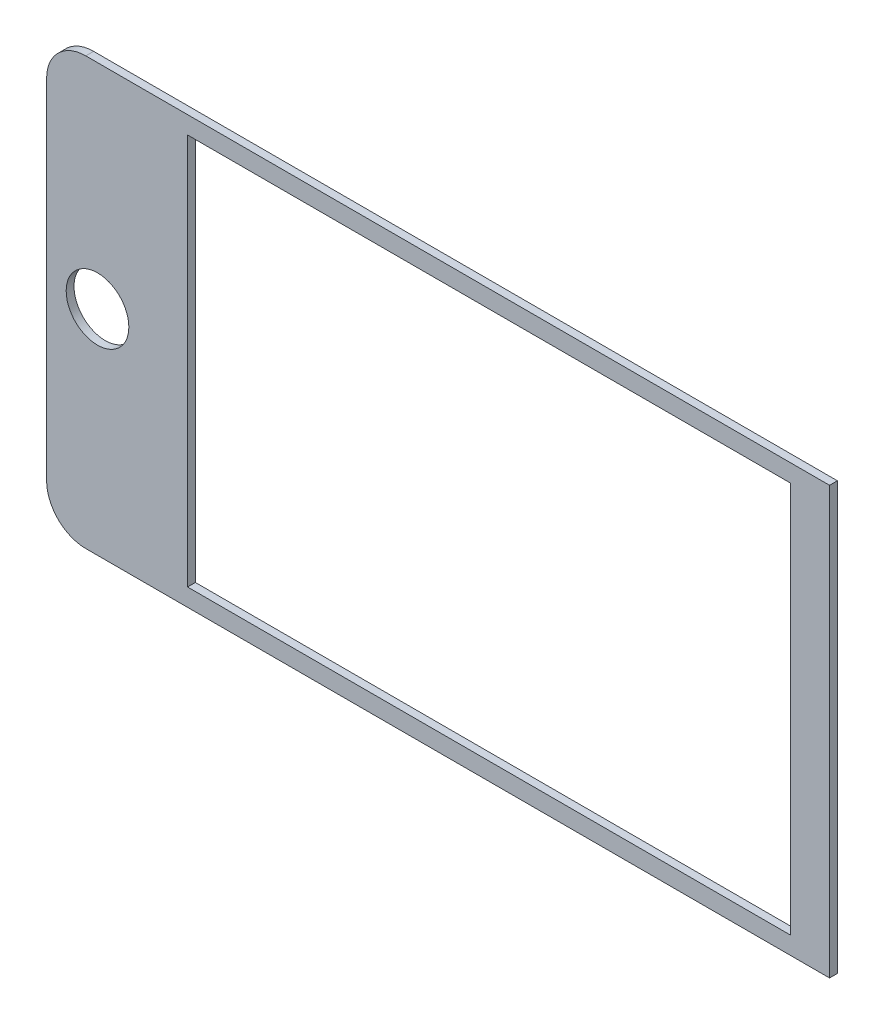
ISO-10303-21;
HEADER;
FILE_DESCRIPTION(('STEP AP214'),'2;1');
FILE_NAME('part.step','',(''),(''),'','','');
FILE_SCHEMA(('AUTOMOTIVE_DESIGN { 1 0 10303 214 1 1 1 1 }'));
ENDSEC;
DATA;
#1=APPLICATION_CONTEXT('core data for automotive mechanical design processes');
#2=APPLICATION_PROTOCOL_DEFINITION('international standard','automotive_design',2000,#1);
#3=PRODUCT_CONTEXT('',#1,'mechanical');
#4=PRODUCT('Part','Part','',(#3));
#5=PRODUCT_RELATED_PRODUCT_CATEGORY('part','',(#4));
#6=PRODUCT_DEFINITION_FORMATION('','',#4);
#7=PRODUCT_DEFINITION_CONTEXT('part definition',#1,'design');
#8=PRODUCT_DEFINITION('design','',#6,#7);
#9=PRODUCT_DEFINITION_SHAPE('','',#8);
#10=(LENGTH_UNIT() NAMED_UNIT(*) SI_UNIT(.MILLI.,.METRE.));
#11=(NAMED_UNIT(*) PLANE_ANGLE_UNIT() SI_UNIT($,.RADIAN.));
#12=(NAMED_UNIT(*) SI_UNIT($,.STERADIAN.) SOLID_ANGLE_UNIT());
#13=UNCERTAINTY_MEASURE_WITH_UNIT(LENGTH_MEASURE(1.E-05),#10,'distance_accuracy_value','');
#14=(GEOMETRIC_REPRESENTATION_CONTEXT(3) GLOBAL_UNCERTAINTY_ASSIGNED_CONTEXT((#13)) GLOBAL_UNIT_ASSIGNED_CONTEXT((#10,
#11,#12)) REPRESENTATION_CONTEXT('',''));
#15=CARTESIAN_POINT('',(0.,0.,0.));
#16=DIRECTION('',(0.,0.,1.));
#17=DIRECTION('',(1.,0.,0.));
#18=AXIS2_PLACEMENT_3D('',#15,#16,#17);
#19=CARTESIAN_POINT('',(-1.11022302462516E-13,0.,2.));
#20=DIRECTION('',(0.,0.,-1.));
#21=DIRECTION('',(-1.,0.,0.));
#22=AXIS2_PLACEMENT_3D('',#19,#20,#21);
#23=PLANE('',#22);
#24=CARTESIAN_POINT('',(-87.,0.,1.99999999999995));
#25=DIRECTION('',(0.,0.,-1.));
#26=DIRECTION('',(-1.,0.,0.));
#27=AXIS2_PLACEMENT_3D('',#24,#25,#26);
#28=CIRCLE('',#27,8.00000000000001);
#29=CARTESIAN_POINT('',(-95.,0.,1.99999999999995));
#30=VERTEX_POINT('',#29);
#31=EDGE_CURVE('E146',#30,#30,#28,.T.);
#32=ORIENTED_EDGE('',*,*,#31,.T.);
#33=EDGE_LOOP('',(#32));
#34=FACE_BOUND('',#33,.T.);
#35=DIRECTION('',(0.,-1.,0.));
#36=VECTOR('',#35,1.);
#37=CARTESIAN_POINT('',(-100.,54.4999999999999,2.));
#38=LINE('',#37,#36);
#39=CARTESIAN_POINT('',(-100.,44.4999999999999,1.99999999999995));
#40=VERTEX_POINT('',#39);
#41=CARTESIAN_POINT('',(-100.,-44.5,2.00000000000006));
#42=VERTEX_POINT('',#41);
#43=EDGE_CURVE('E157',#40,#42,#38,.T.);
#44=ORIENTED_EDGE('',*,*,#43,.T.);
#45=CARTESIAN_POINT('',(-90.,-44.5,1.99999999999995));
#46=DIRECTION('',(0.,0.,-1.));
#47=DIRECTION('',(-1.,0.,0.));
#48=AXIS2_PLACEMENT_3D('',#45,#46,#47);
#49=CIRCLE('',#48,10.);
#50=CARTESIAN_POINT('',(-90.,-54.5,1.99999999999995));
#51=VERTEX_POINT('',#50);
#52=EDGE_CURVE('E42',#42,#51,#49,.F.);
#53=ORIENTED_EDGE('',*,*,#52,.T.);
#54=DIRECTION('',(1.,0.,0.));
#55=VECTOR('',#54,1.);
#56=CARTESIAN_POINT('',(100.,-54.5,2.));
#57=LINE('',#56,#55);
#58=CARTESIAN_POINT('',(100.,-54.5,2.));
#59=VERTEX_POINT('',#58);
#60=EDGE_CURVE('E159',#51,#59,#57,.T.);
#61=ORIENTED_EDGE('',*,*,#60,.T.);
#62=DIRECTION('',(0.,1.,0.));
#63=VECTOR('',#62,1.);
#64=CARTESIAN_POINT('',(100.,54.5,2.));
#65=LINE('',#64,#63);
#66=CARTESIAN_POINT('',(100.,54.5,2.));
#67=VERTEX_POINT('',#66);
#68=EDGE_CURVE('E162',#59,#67,#65,.T.);
#69=ORIENTED_EDGE('',*,*,#68,.T.);
#70=DIRECTION('',(-1.,0.,0.));
#71=VECTOR('',#70,1.);
#72=CARTESIAN_POINT('',(100.,54.5,2.));
#73=LINE('',#72,#71);
#74=CARTESIAN_POINT('',(-90.,54.4999999999999,1.99999999999995));
#75=VERTEX_POINT('',#74);
#76=EDGE_CURVE('E164',#67,#75,#73,.T.);
#77=ORIENTED_EDGE('',*,*,#76,.T.);
#78=CARTESIAN_POINT('',(-90.,44.4999999999999,1.99999999999995));
#79=DIRECTION('',(0.,0.,-1.));
#80=DIRECTION('',(-1.,0.,0.));
#81=AXIS2_PLACEMENT_3D('',#78,#79,#80);
#82=CIRCLE('',#81,10.);
#83=EDGE_CURVE('E189',#75,#40,#82,.F.);
#84=ORIENTED_EDGE('',*,*,#83,.T.);
#85=EDGE_LOOP('',(#44,#53,#61,#69,#77,#84));
#86=FACE_BOUND('',#85,.T.);
#87=DIRECTION('',(0.,-1.,0.));
#88=VECTOR('',#87,1.);
#89=CARTESIAN_POINT('',(-64.,50.,1.99999999999995));
#90=LINE('',#89,#88);
#91=CARTESIAN_POINT('',(-64.,50.,1.99999999999995));
#92=VERTEX_POINT('',#91);
#93=CARTESIAN_POINT('',(-64.0000000000001,-50.,2.));
#94=VERTEX_POINT('',#93);
#95=EDGE_CURVE('E114',#92,#94,#90,.T.);
#96=ORIENTED_EDGE('',*,*,#95,.F.);
#97=DIRECTION('',(-1.,0.,0.));
#98=VECTOR('',#97,1.);
#99=CARTESIAN_POINT('',(90.,50.0000000000001,1.99999999999995));
#100=LINE('',#99,#98);
#101=CARTESIAN_POINT('',(90.,50.0000000000001,1.99999999999995));
#102=VERTEX_POINT('',#101);
#103=EDGE_CURVE('E139',#102,#92,#100,.T.);
#104=ORIENTED_EDGE('',*,*,#103,.F.);
#105=DIRECTION('',(0.,1.,0.));
#106=VECTOR('',#105,1.);
#107=CARTESIAN_POINT('',(90.,50.0000000000001,1.99999999999995));
#108=LINE('',#107,#106);
#109=CARTESIAN_POINT('',(90.0000000000001,-50.,2.));
#110=VERTEX_POINT('',#109);
#111=EDGE_CURVE('E137',#110,#102,#108,.T.);
#112=ORIENTED_EDGE('',*,*,#111,.F.);
#113=DIRECTION('',(1.,0.,0.));
#114=VECTOR('',#113,1.);
#115=CARTESIAN_POINT('',(90.0000000000001,-50.,2.));
#116=LINE('',#115,#114);
#117=EDGE_CURVE('E124',#94,#110,#116,.T.);
#118=ORIENTED_EDGE('',*,*,#117,.F.);
#119=EDGE_LOOP('',(#96,#104,#112,#118));
#120=FACE_BOUND('',#119,.T.);
#121=ADVANCED_FACE('F34',(#34,#86,#120),#23,.F.);
#122=CARTESIAN_POINT('',(0.,0.,0.));
#123=DIRECTION('',(0.,0.,-1.));
#124=DIRECTION('',(-1.,0.,0.));
#125=AXIS2_PLACEMENT_3D('',#122,#123,#124);
#126=PLANE('',#125);
#127=CARTESIAN_POINT('',(-87.,0.,0.));
#128=DIRECTION('',(0.,0.,1.));
#129=DIRECTION('',(1.,0.,0.));
#130=AXIS2_PLACEMENT_3D('',#127,#128,#129);
#131=CIRCLE('',#130,8.00000000000001);
#132=CARTESIAN_POINT('',(-79.,0.,0.));
#133=VERTEX_POINT('',#132);
#134=EDGE_CURVE('E254',#133,#133,#131,.T.);
#135=ORIENTED_EDGE('',*,*,#134,.T.);
#136=EDGE_LOOP('',(#135));
#137=FACE_BOUND('',#136,.T.);
#138=DIRECTION('',(1.,0.,0.));
#139=VECTOR('',#138,1.);
#140=CARTESIAN_POINT('',(100.,-54.5,0.));
#141=LINE('',#140,#139);
#142=CARTESIAN_POINT('',(-90.,-54.5,0.));
#143=VERTEX_POINT('',#142);
#144=CARTESIAN_POINT('',(100.,-54.5,0.));
#145=VERTEX_POINT('',#144);
#146=EDGE_CURVE('E168',#143,#145,#141,.T.);
#147=ORIENTED_EDGE('',*,*,#146,.F.);
#148=CARTESIAN_POINT('',(-90.,-44.5,-1.11022302462516E-13));
#149=DIRECTION('',(0.,0.,-1.));
#150=DIRECTION('',(-1.,0.,0.));
#151=AXIS2_PLACEMENT_3D('',#148,#149,#150);
#152=CIRCLE('',#151,10.);
#153=CARTESIAN_POINT('',(-99.9999999999999,-44.5,0.));
#154=VERTEX_POINT('',#153);
#155=EDGE_CURVE('E183',#143,#154,#152,.T.);
#156=ORIENTED_EDGE('',*,*,#155,.T.);
#157=DIRECTION('',(0.,-1.,0.));
#158=VECTOR('',#157,1.);
#159=CARTESIAN_POINT('',(-99.9999999999999,54.5,0.));
#160=LINE('',#159,#158);
#161=CARTESIAN_POINT('',(-100.,44.5,0.));
#162=VERTEX_POINT('',#161);
#163=EDGE_CURVE('E132',#162,#154,#160,.T.);
#164=ORIENTED_EDGE('',*,*,#163,.F.);
#165=CARTESIAN_POINT('',(-90.,44.5,0.));
#166=DIRECTION('',(0.,0.,-1.));
#167=DIRECTION('',(-1.,0.,0.));
#168=AXIS2_PLACEMENT_3D('',#165,#166,#167);
#169=CIRCLE('',#168,10.);
#170=CARTESIAN_POINT('',(-89.9999999999999,54.5,0.));
#171=VERTEX_POINT('',#170);
#172=EDGE_CURVE('E181',#162,#171,#169,.T.);
#173=ORIENTED_EDGE('',*,*,#172,.T.);
#174=DIRECTION('',(-1.,0.,0.));
#175=VECTOR('',#174,1.);
#176=CARTESIAN_POINT('',(100.,54.4999999999999,0.));
#177=LINE('',#176,#175);
#178=CARTESIAN_POINT('',(100.,54.4999999999999,0.));
#179=VERTEX_POINT('',#178);
#180=EDGE_CURVE('E160',#179,#171,#177,.T.);
#181=ORIENTED_EDGE('',*,*,#180,.F.);
#182=DIRECTION('',(0.,1.,0.));
#183=VECTOR('',#182,1.);
#184=CARTESIAN_POINT('',(100.,54.4999999999999,0.));
#185=LINE('',#184,#183);
#186=EDGE_CURVE('E170',#145,#179,#185,.T.);
#187=ORIENTED_EDGE('',*,*,#186,.F.);
#188=EDGE_LOOP('',(#147,#156,#164,#173,#181,#187));
#189=FACE_BOUND('',#188,.T.);
#190=DIRECTION('',(-1.,0.,0.));
#191=VECTOR('',#190,1.);
#192=CARTESIAN_POINT('',(90.0000000000001,50.0000000000001,0.));
#193=LINE('',#192,#191);
#194=CARTESIAN_POINT('',(90.0000000000001,50.0000000000001,0.));
#195=VERTEX_POINT('',#194);
#196=CARTESIAN_POINT('',(-64.,50.0000000000001,0.));
#197=VERTEX_POINT('',#196);
#198=EDGE_CURVE('E125',#195,#197,#193,.T.);
#199=ORIENTED_EDGE('',*,*,#198,.T.);
#200=DIRECTION('',(0.,-1.,0.));
#201=VECTOR('',#200,1.);
#202=CARTESIAN_POINT('',(-64.,50.0000000000001,0.));
#203=LINE('',#202,#201);
#204=CARTESIAN_POINT('',(-64.,-50.,0.));
#205=VERTEX_POINT('',#204);
#206=EDGE_CURVE('E144',#197,#205,#203,.T.);
#207=ORIENTED_EDGE('',*,*,#206,.T.);
#208=DIRECTION('',(1.,0.,0.));
#209=VECTOR('',#208,1.);
#210=CARTESIAN_POINT('',(90.0000000000001,-50.,0.));
#211=LINE('',#210,#209);
#212=CARTESIAN_POINT('',(90.0000000000001,-50.,0.));
#213=VERTEX_POINT('',#212);
#214=EDGE_CURVE('E131',#205,#213,#211,.T.);
#215=ORIENTED_EDGE('',*,*,#214,.T.);
#216=DIRECTION('',(0.,1.,0.));
#217=VECTOR('',#216,1.);
#218=CARTESIAN_POINT('',(90.0000000000001,50.0000000000001,0.));
#219=LINE('',#218,#217);
#220=EDGE_CURVE('E148',#213,#195,#219,.T.);
#221=ORIENTED_EDGE('',*,*,#220,.T.);
#222=EDGE_LOOP('',(#199,#207,#215,#221));
#223=FACE_BOUND('',#222,.T.);
#224=ADVANCED_FACE('F203',(#137,#189,#223),#126,.T.);
#225=CARTESIAN_POINT('',(-100.,54.4999999999999,2.));
#226=DIRECTION('',(1.,0.,0.));
#227=DIRECTION('',(0.,0.,-1.));
#228=AXIS2_PLACEMENT_3D('',#225,#226,#227);
#229=PLANE('',#228);
#230=ORIENTED_EDGE('',*,*,#163,.T.);
#231=DIRECTION('',(0.,0.,-1.));
#232=VECTOR('',#231,1.);
#233=CARTESIAN_POINT('',(-100.,-44.5,2.00000000000006));
#234=LINE('',#233,#232);
#235=EDGE_CURVE('E55',#154,#42,#234,.F.);
#236=ORIENTED_EDGE('',*,*,#235,.T.);
#237=ORIENTED_EDGE('',*,*,#43,.F.);
#238=DIRECTION('',(0.,0.,-1.));
#239=VECTOR('',#238,1.);
#240=CARTESIAN_POINT('',(-100.,44.4999999999999,1.99999999999995));
#241=LINE('',#240,#239);
#242=EDGE_CURVE('E185',#40,#162,#241,.T.);
#243=ORIENTED_EDGE('',*,*,#242,.T.);
#244=EDGE_LOOP('',(#230,#236,#237,#243));
#245=FACE_BOUND('',#244,.T.);
#246=ADVANCED_FACE('F206',(#245),#229,.F.);
#247=CARTESIAN_POINT('',(100.,-54.5,2.));
#248=DIRECTION('',(0.,1.,0.));
#249=DIRECTION('',(-1.,0.,0.));
#250=AXIS2_PLACEMENT_3D('',#247,#248,#249);
#251=PLANE('',#250);
#252=ORIENTED_EDGE('',*,*,#60,.F.);
#253=DIRECTION('',(0.,0.,-1.));
#254=VECTOR('',#253,1.);
#255=CARTESIAN_POINT('',(-90.,-54.5,1.99999999999995));
#256=LINE('',#255,#254);
#257=EDGE_CURVE('E178',#51,#143,#256,.T.);
#258=ORIENTED_EDGE('',*,*,#257,.T.);
#259=ORIENTED_EDGE('',*,*,#146,.T.);
#260=DIRECTION('',(0.,0.,-1.));
#261=VECTOR('',#260,1.);
#262=CARTESIAN_POINT('',(100.,-54.5,2.));
#263=LINE('',#262,#261);
#264=EDGE_CURVE('E175',#59,#145,#263,.T.);
#265=ORIENTED_EDGE('',*,*,#264,.F.);
#266=EDGE_LOOP('',(#252,#258,#259,#265));
#267=FACE_BOUND('',#266,.T.);
#268=ADVANCED_FACE('F197',(#267),#251,.F.);
#269=CARTESIAN_POINT('',(100.,54.5,2.));
#270=DIRECTION('',(-1.,0.,0.));
#271=DIRECTION('',(0.,-1.,0.));
#272=AXIS2_PLACEMENT_3D('',#269,#270,#271);
#273=PLANE('',#272);
#274=ORIENTED_EDGE('',*,*,#186,.T.);
#275=DIRECTION('',(0.,0.,-1.));
#276=VECTOR('',#275,1.);
#277=CARTESIAN_POINT('',(100.,54.5,2.));
#278=LINE('',#277,#276);
#279=EDGE_CURVE('E166',#67,#179,#278,.T.);
#280=ORIENTED_EDGE('',*,*,#279,.F.);
#281=ORIENTED_EDGE('',*,*,#68,.F.);
#282=ORIENTED_EDGE('',*,*,#264,.T.);
#283=EDGE_LOOP('',(#274,#280,#281,#282));
#284=FACE_BOUND('',#283,.T.);
#285=ADVANCED_FACE('F214',(#284),#273,.F.);
#286=CARTESIAN_POINT('',(100.,54.5,2.));
#287=DIRECTION('',(0.,-1.,0.));
#288=DIRECTION('',(1.,0.,0.));
#289=AXIS2_PLACEMENT_3D('',#286,#287,#288);
#290=PLANE('',#289);
#291=ORIENTED_EDGE('',*,*,#180,.T.);
#292=DIRECTION('',(0.,0.,-1.));
#293=VECTOR('',#292,1.);
#294=CARTESIAN_POINT('',(-90.,54.4999999999999,1.99999999999995));
#295=LINE('',#294,#293);
#296=EDGE_CURVE('E11',#171,#75,#295,.F.);
#297=ORIENTED_EDGE('',*,*,#296,.T.);
#298=ORIENTED_EDGE('',*,*,#76,.F.);
#299=ORIENTED_EDGE('',*,*,#279,.T.);
#300=EDGE_LOOP('',(#291,#297,#298,#299));
#301=FACE_BOUND('',#300,.T.);
#302=ADVANCED_FACE('F211',(#301),#290,.F.);
#303=CARTESIAN_POINT('',(-64.,50.,1.99999999999995));
#304=DIRECTION('',(1.,0.,0.));
#305=DIRECTION('',(0.,1.,0.));
#306=AXIS2_PLACEMENT_3D('',#303,#304,#305);
#307=PLANE('',#306);
#308=ORIENTED_EDGE('',*,*,#206,.F.);
#309=DIRECTION('',(0.,0.,-1.));
#310=VECTOR('',#309,1.);
#311=CARTESIAN_POINT('',(-64.,50.,1.99999999999995));
#312=LINE('',#311,#310);
#313=EDGE_CURVE('E120',#92,#197,#312,.T.);
#314=ORIENTED_EDGE('',*,*,#313,.F.);
#315=ORIENTED_EDGE('',*,*,#95,.T.);
#316=DIRECTION('',(0.,0.,-1.));
#317=VECTOR('',#316,1.);
#318=CARTESIAN_POINT('',(-64.0000000000001,-50.,2.));
#319=LINE('',#318,#317);
#320=EDGE_CURVE('E117',#94,#205,#319,.T.);
#321=ORIENTED_EDGE('',*,*,#320,.T.);
#322=EDGE_LOOP('',(#308,#314,#315,#321));
#323=FACE_BOUND('',#322,.T.);
#324=ADVANCED_FACE('F116',(#323),#307,.T.);
#325=CARTESIAN_POINT('',(90.0000000000001,-50.,2.));
#326=DIRECTION('',(0.,1.,0.));
#327=DIRECTION('',(-1.,0.,0.));
#328=AXIS2_PLACEMENT_3D('',#325,#326,#327);
#329=PLANE('',#328);
#330=ORIENTED_EDGE('',*,*,#214,.F.);
#331=ORIENTED_EDGE('',*,*,#320,.F.);
#332=ORIENTED_EDGE('',*,*,#117,.T.);
#333=DIRECTION('',(0.,0.,-1.));
#334=VECTOR('',#333,1.);
#335=CARTESIAN_POINT('',(90.0000000000001,-50.,2.));
#336=LINE('',#335,#334);
#337=EDGE_CURVE('E133',#110,#213,#336,.T.);
#338=ORIENTED_EDGE('',*,*,#337,.T.);
#339=EDGE_LOOP('',(#330,#331,#332,#338));
#340=FACE_BOUND('',#339,.T.);
#341=ADVANCED_FACE('F128',(#340),#329,.T.);
#342=CARTESIAN_POINT('',(90.,50.0000000000001,1.99999999999995));
#343=DIRECTION('',(-1.,0.,0.));
#344=DIRECTION('',(0.,-1.,0.));
#345=AXIS2_PLACEMENT_3D('',#342,#343,#344);
#346=PLANE('',#345);
#347=ORIENTED_EDGE('',*,*,#220,.F.);
#348=ORIENTED_EDGE('',*,*,#337,.F.);
#349=ORIENTED_EDGE('',*,*,#111,.T.);
#350=DIRECTION('',(0.,0.,-1.));
#351=VECTOR('',#350,1.);
#352=CARTESIAN_POINT('',(90.,50.0000000000001,1.99999999999995));
#353=LINE('',#352,#351);
#354=EDGE_CURVE('E154',#102,#195,#353,.T.);
#355=ORIENTED_EDGE('',*,*,#354,.T.);
#356=EDGE_LOOP('',(#347,#348,#349,#355));
#357=FACE_BOUND('',#356,.T.);
#358=ADVANCED_FACE('F237',(#357),#346,.T.);
#359=CARTESIAN_POINT('',(90.,50.0000000000001,1.99999999999995));
#360=DIRECTION('',(0.,-1.,0.));
#361=DIRECTION('',(1.,0.,0.));
#362=AXIS2_PLACEMENT_3D('',#359,#360,#361);
#363=PLANE('',#362);
#364=ORIENTED_EDGE('',*,*,#198,.F.);
#365=ORIENTED_EDGE('',*,*,#354,.F.);
#366=ORIENTED_EDGE('',*,*,#103,.T.);
#367=ORIENTED_EDGE('',*,*,#313,.T.);
#368=EDGE_LOOP('',(#364,#365,#366,#367));
#369=FACE_BOUND('',#368,.T.);
#370=ADVANCED_FACE('F240',(#369),#363,.T.);
#371=CARTESIAN_POINT('',(-90.,-44.5,1.99999999999995));
#372=DIRECTION('',(0.,0.,-1.));
#373=DIRECTION('',(-1.,0.,0.));
#374=AXIS2_PLACEMENT_3D('',#371,#372,#373);
#375=CYLINDRICAL_SURFACE('',#374,10.);
#376=ORIENTED_EDGE('',*,*,#52,.F.);
#377=ORIENTED_EDGE('',*,*,#235,.F.);
#378=ORIENTED_EDGE('',*,*,#155,.F.);
#379=ORIENTED_EDGE('',*,*,#257,.F.);
#380=EDGE_LOOP('',(#376,#377,#378,#379));
#381=FACE_BOUND('',#380,.T.);
#382=ADVANCED_FACE('F200',(#381),#375,.T.);
#383=CARTESIAN_POINT('',(-90.,44.4999999999999,1.99999999999995));
#384=DIRECTION('',(0.,0.,-1.));
#385=DIRECTION('',(-1.,0.,0.));
#386=AXIS2_PLACEMENT_3D('',#383,#384,#385);
#387=CYLINDRICAL_SURFACE('',#386,10.);
#388=ORIENTED_EDGE('',*,*,#83,.F.);
#389=ORIENTED_EDGE('',*,*,#296,.F.);
#390=ORIENTED_EDGE('',*,*,#172,.F.);
#391=ORIENTED_EDGE('',*,*,#242,.F.);
#392=EDGE_LOOP('',(#388,#389,#390,#391));
#393=FACE_BOUND('',#392,.T.);
#394=ADVANCED_FACE('F36',(#393),#387,.T.);
#395=CARTESIAN_POINT('',(-87.,0.,0.));
#396=DIRECTION('',(0.,0.,1.));
#397=DIRECTION('',(1.,0.,0.));
#398=AXIS2_PLACEMENT_3D('',#395,#396,#397);
#399=CYLINDRICAL_SURFACE('',#398,8.00000000000001);
#400=ORIENTED_EDGE('',*,*,#134,.F.);
#401=EDGE_LOOP('',(#400));
#402=FACE_BOUND('',#401,.T.);
#403=ORIENTED_EDGE('',*,*,#31,.F.);
#404=EDGE_LOOP('',(#403));
#405=FACE_BOUND('',#404,.T.);
#406=ADVANCED_FACE('F245',(#402,#405),#399,.F.);
#407=CLOSED_SHELL('',(#121,#224,#246,#268,#285,#302,#324,#341,#358,#370,#382,#394,#406));
#408=MANIFOLD_SOLID_BREP('B2',#407);
#409=ADVANCED_BREP_SHAPE_REPRESENTATION('',(#18,#408),#14);
#410=SHAPE_DEFINITION_REPRESENTATION(#9,#409);
ENDSEC;
END-ISO-10303-21;
